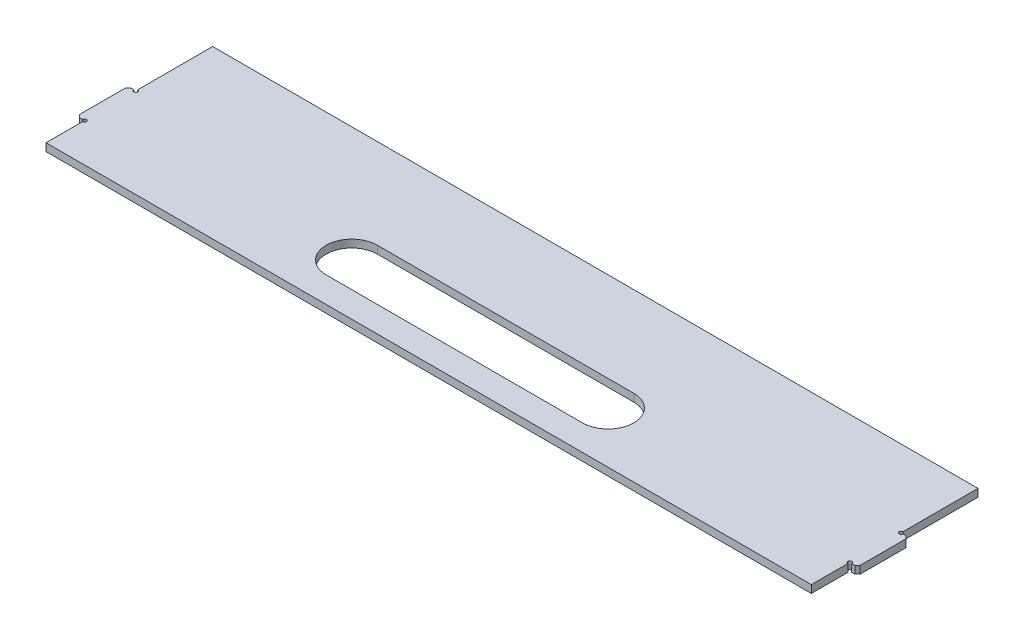
ISO-10303-21;
HEADER;
FILE_DESCRIPTION(('STEP AP214'),'2;1');
FILE_NAME('part.step','',(''),(''),'','','');
FILE_SCHEMA(('AUTOMOTIVE_DESIGN { 1 0 10303 214 1 1 1 1 }'));
ENDSEC;
DATA;
#1=APPLICATION_CONTEXT('core data for automotive mechanical design processes');
#2=APPLICATION_PROTOCOL_DEFINITION('international standard','automotive_design',2000,#1);
#3=PRODUCT_CONTEXT('',#1,'mechanical');
#4=PRODUCT('Part','Part','',(#3));
#5=PRODUCT_RELATED_PRODUCT_CATEGORY('part','',(#4));
#6=PRODUCT_DEFINITION_FORMATION('','',#4);
#7=PRODUCT_DEFINITION_CONTEXT('part definition',#1,'design');
#8=PRODUCT_DEFINITION('design','',#6,#7);
#9=PRODUCT_DEFINITION_SHAPE('','',#8);
#10=(LENGTH_UNIT() NAMED_UNIT(*) SI_UNIT(.MILLI.,.METRE.));
#11=(NAMED_UNIT(*) PLANE_ANGLE_UNIT() SI_UNIT($,.RADIAN.));
#12=(NAMED_UNIT(*) SI_UNIT($,.STERADIAN.) SOLID_ANGLE_UNIT());
#13=UNCERTAINTY_MEASURE_WITH_UNIT(LENGTH_MEASURE(1.E-05),#10,'distance_accuracy_value','');
#14=(GEOMETRIC_REPRESENTATION_CONTEXT(3) GLOBAL_UNCERTAINTY_ASSIGNED_CONTEXT((#13)) GLOBAL_UNIT_ASSIGNED_CONTEXT((#10,
#11,#12)) REPRESENTATION_CONTEXT('',''));
#15=CARTESIAN_POINT('',(0.,0.,0.));
#16=DIRECTION('',(0.,0.,1.));
#17=DIRECTION('',(1.,0.,0.));
#18=AXIS2_PLACEMENT_3D('',#15,#16,#17);
#19=CARTESIAN_POINT('',(149.25,-3.,32.5));
#20=DIRECTION('',(1.,0.,0.));
#21=DIRECTION('',(0.,0.,-1.));
#22=AXIS2_PLACEMENT_3D('',#19,#20,#21);
#23=PLANE('',#22);
#24=DIRECTION('',(0.,-1.,0.));
#25=VECTOR('',#24,1.);
#26=CARTESIAN_POINT('',(149.25,-3.,18.25));
#27=LINE('',#26,#25);
#28=CARTESIAN_POINT('',(149.25,0.,18.25));
#29=VERTEX_POINT('',#28);
#30=CARTESIAN_POINT('',(149.25,-3.,18.25));
#31=VERTEX_POINT('',#30);
#32=EDGE_CURVE('E100',#29,#31,#27,.T.);
#33=ORIENTED_EDGE('',*,*,#32,.F.);
#34=DIRECTION('',(0.,0.,-1.));
#35=VECTOR('',#34,1.);
#36=CARTESIAN_POINT('',(149.25,0.,32.5));
#37=LINE('',#36,#35);
#38=CARTESIAN_POINT('',(149.25,0.,32.5));
#39=VERTEX_POINT('',#38);
#40=EDGE_CURVE('E382',#39,#29,#37,.T.);
#41=ORIENTED_EDGE('',*,*,#40,.F.);
#42=DIRECTION('',(0.,1.,0.));
#43=VECTOR('',#42,1.);
#44=CARTESIAN_POINT('',(149.25,-3.,32.5));
#45=LINE('',#44,#43);
#46=CARTESIAN_POINT('',(149.25,-3.,32.5));
#47=VERTEX_POINT('',#46);
#48=EDGE_CURVE('E395',#47,#39,#45,.T.);
#49=ORIENTED_EDGE('',*,*,#48,.F.);
#50=DIRECTION('',(0.,0.,-1.));
#51=VECTOR('',#50,1.);
#52=CARTESIAN_POINT('',(149.25,-3.,32.5));
#53=LINE('',#52,#51);
#54=EDGE_CURVE('E367',#47,#31,#53,.T.);
#55=ORIENTED_EDGE('',*,*,#54,.T.);
#56=EDGE_LOOP('',(#33,#41,#49,#55));
#57=FACE_BOUND('',#56,.T.);
#58=ADVANCED_FACE('F93',(#57),#23,.T.);
#59=DIRECTION('',(0.,-1.,0.));
#60=VECTOR('',#59,1.);
#61=CARTESIAN_POINT('',(149.25,-3.,-3.24999999999998));
#62=LINE('',#61,#60);
#63=CARTESIAN_POINT('',(149.25,-3.,-3.24999999999998));
#64=VERTEX_POINT('',#63);
#65=CARTESIAN_POINT('',(149.25,0.,-3.24999999999998));
#66=VERTEX_POINT('',#65);
#67=EDGE_CURVE('E107',#64,#66,#62,.F.);
#68=ORIENTED_EDGE('',*,*,#67,.F.);
#69=CARTESIAN_POINT('',(149.25,-3.,-32.5));
#70=VERTEX_POINT('',#69);
#71=EDGE_CURVE('E371',#64,#70,#53,.T.);
#72=ORIENTED_EDGE('',*,*,#71,.T.);
#73=DIRECTION('',(0.,1.,0.));
#74=VECTOR('',#73,1.);
#75=CARTESIAN_POINT('',(149.25,-3.,-32.5));
#76=LINE('',#75,#74);
#77=CARTESIAN_POINT('',(149.25,0.,-32.5));
#78=VERTEX_POINT('',#77);
#79=EDGE_CURVE('E381',#70,#78,#76,.T.);
#80=ORIENTED_EDGE('',*,*,#79,.T.);
#81=EDGE_CURVE('E360',#66,#78,#37,.T.);
#82=ORIENTED_EDGE('',*,*,#81,.F.);
#83=EDGE_LOOP('',(#68,#72,#80,#82));
#84=FACE_BOUND('',#83,.T.);
#85=ADVANCED_FACE('F474',(#84),#23,.T.);
#86=CARTESIAN_POINT('',(-149.25,-3.,32.5));
#87=DIRECTION('',(-1.,0.,0.));
#88=DIRECTION('',(0.,0.,1.));
#89=AXIS2_PLACEMENT_3D('',#86,#87,#88);
#90=PLANE('',#89);
#91=DIRECTION('',(0.,-1.,0.));
#92=VECTOR('',#91,1.);
#93=CARTESIAN_POINT('',(-149.25,-3.,18.25));
#94=LINE('',#93,#92);
#95=CARTESIAN_POINT('',(-149.25,-3.,18.25));
#96=VERTEX_POINT('',#95);
#97=CARTESIAN_POINT('',(-149.25,0.,18.25));
#98=VERTEX_POINT('',#97);
#99=EDGE_CURVE('E273',#96,#98,#94,.F.);
#100=ORIENTED_EDGE('',*,*,#99,.F.);
#101=DIRECTION('',(0.,0.,1.));
#102=VECTOR('',#101,1.);
#103=CARTESIAN_POINT('',(-149.25,-3.,32.5));
#104=LINE('',#103,#102);
#105=CARTESIAN_POINT('',(-149.25,-3.,32.5));
#106=VERTEX_POINT('',#105);
#107=EDGE_CURVE('E374',#96,#106,#104,.T.);
#108=ORIENTED_EDGE('',*,*,#107,.T.);
#109=DIRECTION('',(0.,1.,0.));
#110=VECTOR('',#109,1.);
#111=CARTESIAN_POINT('',(-149.25,-3.,32.5));
#112=LINE('',#111,#110);
#113=CARTESIAN_POINT('',(-149.25,0.,32.5));
#114=VERTEX_POINT('',#113);
#115=EDGE_CURVE('E398',#106,#114,#112,.T.);
#116=ORIENTED_EDGE('',*,*,#115,.T.);
#117=DIRECTION('',(0.,0.,1.));
#118=VECTOR('',#117,1.);
#119=CARTESIAN_POINT('',(-149.25,0.,32.5));
#120=LINE('',#119,#118);
#121=EDGE_CURVE('E388',#98,#114,#120,.T.);
#122=ORIENTED_EDGE('',*,*,#121,.F.);
#123=EDGE_LOOP('',(#100,#108,#116,#122));
#124=FACE_BOUND('',#123,.T.);
#125=ADVANCED_FACE('F500',(#124),#90,.T.);
#126=DIRECTION('',(0.,-1.,0.));
#127=VECTOR('',#126,1.);
#128=CARTESIAN_POINT('',(-149.25,-3.,-3.24999999999998));
#129=LINE('',#128,#127);
#130=CARTESIAN_POINT('',(-149.25,0.,-3.24999999999998));
#131=VERTEX_POINT('',#130);
#132=CARTESIAN_POINT('',(-149.25,-3.,-3.24999999999998));
#133=VERTEX_POINT('',#132);
#134=EDGE_CURVE('E415',#131,#133,#129,.T.);
#135=ORIENTED_EDGE('',*,*,#134,.F.);
#136=CARTESIAN_POINT('',(-149.25,0.,-32.5));
#137=VERTEX_POINT('',#136);
#138=EDGE_CURVE('E389',#137,#131,#120,.T.);
#139=ORIENTED_EDGE('',*,*,#138,.F.);
#140=DIRECTION('',(0.,1.,0.));
#141=VECTOR('',#140,1.);
#142=CARTESIAN_POINT('',(-149.25,-3.,-32.5));
#143=LINE('',#142,#141);
#144=CARTESIAN_POINT('',(-149.25,-3.,-32.5));
#145=VERTEX_POINT('',#144);
#146=EDGE_CURVE('E401',#145,#137,#143,.T.);
#147=ORIENTED_EDGE('',*,*,#146,.F.);
#148=EDGE_CURVE('E375',#145,#133,#104,.T.);
#149=ORIENTED_EDGE('',*,*,#148,.T.);
#150=EDGE_LOOP('',(#135,#139,#147,#149));
#151=FACE_BOUND('',#150,.T.);
#152=ADVANCED_FACE('F468',(#151),#90,.T.);
#153=CARTESIAN_POINT('',(-149.25,-3.,32.5));
#154=DIRECTION('',(0.,0.,1.));
#155=DIRECTION('',(1.,0.,0.));
#156=AXIS2_PLACEMENT_3D('',#153,#154,#155);
#157=PLANE('',#156);
#158=DIRECTION('',(1.,0.,0.));
#159=VECTOR('',#158,1.);
#160=CARTESIAN_POINT('',(-149.25,0.,32.5));
#161=LINE('',#160,#159);
#162=EDGE_CURVE('E392',#114,#39,#161,.T.);
#163=ORIENTED_EDGE('',*,*,#162,.F.);
#164=ORIENTED_EDGE('',*,*,#115,.F.);
#165=DIRECTION('',(1.,0.,0.));
#166=VECTOR('',#165,1.);
#167=CARTESIAN_POINT('',(-149.25,-3.,32.5));
#168=LINE('',#167,#166);
#169=EDGE_CURVE('E378',#106,#47,#168,.T.);
#170=ORIENTED_EDGE('',*,*,#169,.T.);
#171=ORIENTED_EDGE('',*,*,#48,.T.);
#172=EDGE_LOOP('',(#163,#164,#170,#171));
#173=FACE_BOUND('',#172,.T.);
#174=ADVANCED_FACE('F504',(#173),#157,.T.);
#175=CARTESIAN_POINT('',(-149.25,-3.,-32.5));
#176=DIRECTION('',(0.,0.,-1.));
#177=DIRECTION('',(-1.,0.,0.));
#178=AXIS2_PLACEMENT_3D('',#175,#176,#177);
#179=PLANE('',#178);
#180=DIRECTION('',(-1.,0.,0.));
#181=VECTOR('',#180,1.);
#182=CARTESIAN_POINT('',(-149.25,0.,-32.5));
#183=LINE('',#182,#181);
#184=EDGE_CURVE('E385',#78,#137,#183,.T.);
#185=ORIENTED_EDGE('',*,*,#184,.F.);
#186=ORIENTED_EDGE('',*,*,#79,.F.);
#187=DIRECTION('',(-1.,0.,0.));
#188=VECTOR('',#187,1.);
#189=CARTESIAN_POINT('',(-149.25,-3.,-32.5));
#190=LINE('',#189,#188);
#191=EDGE_CURVE('E370',#70,#145,#190,.T.);
#192=ORIENTED_EDGE('',*,*,#191,.T.);
#193=ORIENTED_EDGE('',*,*,#146,.T.);
#194=EDGE_LOOP('',(#185,#186,#192,#193));
#195=FACE_BOUND('',#194,.T.);
#196=ADVANCED_FACE('F471',(#195),#179,.T.);
#197=CARTESIAN_POINT('',(0.,-3.,0.));
#198=DIRECTION('',(0.,-1.,0.));
#199=DIRECTION('',(0.,0.,-1.));
#200=AXIS2_PLACEMENT_3D('',#197,#198,#199);
#201=PLANE('',#200);
#202=CARTESIAN_POINT('',(149.25,-3.,-2.50000000000001));
#203=DIRECTION('',(0.,-1.,0.));
#204=DIRECTION('',(0.,0.,-1.));
#205=AXIS2_PLACEMENT_3D('',#202,#203,#204);
#206=CIRCLE('',#205,0.749999999999973);
#207=CARTESIAN_POINT('',(150.,-3.,-2.50000000000001));
#208=VERTEX_POINT('',#207);
#209=EDGE_CURVE('E263',#208,#64,#206,.T.);
#210=ORIENTED_EDGE('',*,*,#209,.F.);
#211=DIRECTION('',(-1.,0.,0.));
#212=VECTOR('',#211,1.);
#213=CARTESIAN_POINT('',(155.25,-3.,-2.50000000000001));
#214=LINE('',#213,#212);
#215=CARTESIAN_POINT('',(151.25,-3.,-2.50000000000001));
#216=VERTEX_POINT('',#215);
#217=EDGE_CURVE('E262',#216,#208,#214,.T.);
#218=ORIENTED_EDGE('',*,*,#217,.F.);
#219=DIRECTION('',(0.707106781186537,0.,0.707106781186558));
#220=VECTOR('',#219,1.);
#221=CARTESIAN_POINT('',(153.25,-3.,-0.499999999999934));
#222=LINE('',#221,#220);
#223=CARTESIAN_POINT('',(152.25,-3.,-1.49999999999999));
#224=VERTEX_POINT('',#223);
#225=EDGE_CURVE('E294',#216,#224,#222,.T.);
#226=ORIENTED_EDGE('',*,*,#225,.T.);
#227=DIRECTION('',(0.,0.,-1.));
#228=VECTOR('',#227,1.);
#229=CARTESIAN_POINT('',(152.25,-3.,-2.50000000000001));
#230=LINE('',#229,#228);
#231=CARTESIAN_POINT('',(152.25,-3.,16.5));
#232=VERTEX_POINT('',#231);
#233=EDGE_CURVE('E281',#232,#224,#230,.T.);
#234=ORIENTED_EDGE('',*,*,#233,.F.);
#235=DIRECTION('',(-0.707106781186546,0.,0.707106781186549));
#236=VECTOR('',#235,1.);
#237=CARTESIAN_POINT('',(163.25,-3.,5.49999999999986));
#238=LINE('',#237,#236);
#239=CARTESIAN_POINT('',(151.25,-3.,17.5));
#240=VERTEX_POINT('',#239);
#241=EDGE_CURVE('E292',#232,#240,#238,.T.);
#242=ORIENTED_EDGE('',*,*,#241,.T.);
#243=DIRECTION('',(-1.,0.,0.));
#244=VECTOR('',#243,1.);
#245=CARTESIAN_POINT('',(155.25,-3.,17.5));
#246=LINE('',#245,#244);
#247=CARTESIAN_POINT('',(150.,-3.,17.5));
#248=VERTEX_POINT('',#247);
#249=EDGE_CURVE('E270',#240,#248,#246,.T.);
#250=ORIENTED_EDGE('',*,*,#249,.T.);
#251=CARTESIAN_POINT('',(149.25,-3.,17.5));
#252=DIRECTION('',(0.,-1.,0.));
#253=DIRECTION('',(0.,0.,-1.));
#254=AXIS2_PLACEMENT_3D('',#251,#252,#253);
#255=CIRCLE('',#254,0.749999999999973);
#256=EDGE_CURVE('E426',#31,#248,#255,.T.);
#257=ORIENTED_EDGE('',*,*,#256,.F.);
#258=ORIENTED_EDGE('',*,*,#54,.F.);
#259=ORIENTED_EDGE('',*,*,#169,.F.);
#260=ORIENTED_EDGE('',*,*,#107,.F.);
#261=CARTESIAN_POINT('',(-149.25,-3.,17.5));
#262=DIRECTION('',(0.,-1.,0.));
#263=DIRECTION('',(0.,0.,-1.));
#264=AXIS2_PLACEMENT_3D('',#261,#262,#263);
#265=CIRCLE('',#264,0.749999999999973);
#266=CARTESIAN_POINT('',(-150.,-3.,17.5));
#267=VERTEX_POINT('',#266);
#268=EDGE_CURVE('E406',#267,#96,#265,.T.);
#269=ORIENTED_EDGE('',*,*,#268,.F.);
#270=DIRECTION('',(1.,0.,0.));
#271=VECTOR('',#270,1.);
#272=CARTESIAN_POINT('',(-155.25,-3.,17.5));
#273=LINE('',#272,#271);
#274=CARTESIAN_POINT('',(-151.25,-3.,17.5));
#275=VERTEX_POINT('',#274);
#276=EDGE_CURVE('E309',#275,#267,#273,.T.);
#277=ORIENTED_EDGE('',*,*,#276,.F.);
#278=DIRECTION('',(0.707106781186544,0.,0.707106781186551));
#279=VECTOR('',#278,1.);
#280=CARTESIAN_POINT('',(-153.25,-3.,15.5));
#281=LINE('',#280,#279);
#282=CARTESIAN_POINT('',(-152.25,-3.,16.5));
#283=VERTEX_POINT('',#282);
#284=EDGE_CURVE('E327',#275,#283,#281,.F.);
#285=ORIENTED_EDGE('',*,*,#284,.T.);
#286=DIRECTION('',(0.,0.,-1.));
#287=VECTOR('',#286,1.);
#288=CARTESIAN_POINT('',(-152.25,-3.,17.5));
#289=LINE('',#288,#287);
#290=CARTESIAN_POINT('',(-152.25,-3.,-1.50000000000002));
#291=VERTEX_POINT('',#290);
#292=EDGE_CURVE('E298',#283,#291,#289,.T.);
#293=ORIENTED_EDGE('',*,*,#292,.T.);
#294=DIRECTION('',(-0.707106781186555,0.,0.70710678118654));
#295=VECTOR('',#294,1.);
#296=CARTESIAN_POINT('',(-163.25,-3.,9.49999999999976));
#297=LINE('',#296,#295);
#298=CARTESIAN_POINT('',(-151.25,-3.,-2.50000000000001));
#299=VERTEX_POINT('',#298);
#300=EDGE_CURVE('E329',#291,#299,#297,.F.);
#301=ORIENTED_EDGE('',*,*,#300,.T.);
#302=DIRECTION('',(1.,0.,0.));
#303=VECTOR('',#302,1.);
#304=CARTESIAN_POINT('',(-155.25,-3.,-2.50000000000001));
#305=LINE('',#304,#303);
#306=CARTESIAN_POINT('',(-150.,-3.,-2.50000000000001));
#307=VERTEX_POINT('',#306);
#308=EDGE_CURVE('E301',#299,#307,#305,.T.);
#309=ORIENTED_EDGE('',*,*,#308,.T.);
#310=CARTESIAN_POINT('',(-149.25,-3.,-2.50000000000001));
#311=DIRECTION('',(0.,-1.,0.));
#312=DIRECTION('',(0.,0.,-1.));
#313=AXIS2_PLACEMENT_3D('',#310,#311,#312);
#314=CIRCLE('',#313,0.749999999999973);
#315=EDGE_CURVE('E454',#133,#307,#314,.T.);
#316=ORIENTED_EDGE('',*,*,#315,.F.);
#317=ORIENTED_EDGE('',*,*,#148,.F.);
#318=ORIENTED_EDGE('',*,*,#191,.F.);
#319=ORIENTED_EDGE('',*,*,#71,.F.);
#320=EDGE_LOOP('',(#210,#218,#226,#234,#242,#250,#257,#258,#259,#260,#269,#277,#285,#293,#301,
#309,#316,#317,#318,#319));
#321=FACE_BOUND('',#320,.T.);
#322=CARTESIAN_POINT('',(-50.,-3.,12.5));
#323=DIRECTION('',(0.,1.,0.));
#324=DIRECTION('',(0.,0.,1.));
#325=AXIS2_PLACEMENT_3D('',#322,#323,#324);
#326=CIRCLE('',#325,10.);
#327=CARTESIAN_POINT('',(-50.,-3.,2.49999999999999));
#328=VERTEX_POINT('',#327);
#329=CARTESIAN_POINT('',(-50.,-3.,22.5));
#330=VERTEX_POINT('',#329);
#331=EDGE_CURVE('E335',#328,#330,#326,.T.);
#332=ORIENTED_EDGE('',*,*,#331,.T.);
#333=DIRECTION('',(1.,0.,0.));
#334=VECTOR('',#333,1.);
#335=CARTESIAN_POINT('',(-50.,-3.,22.5));
#336=LINE('',#335,#334);
#337=CARTESIAN_POINT('',(50.,-3.,22.5));
#338=VERTEX_POINT('',#337);
#339=EDGE_CURVE('E338',#330,#338,#336,.T.);
#340=ORIENTED_EDGE('',*,*,#339,.T.);
#341=CARTESIAN_POINT('',(50.,-3.,12.5));
#342=DIRECTION('',(0.,1.,0.));
#343=DIRECTION('',(0.,0.,1.));
#344=AXIS2_PLACEMENT_3D('',#341,#342,#343);
#345=CIRCLE('',#344,10.);
#346=CARTESIAN_POINT('',(50.,-3.,2.49999999999999));
#347=VERTEX_POINT('',#346);
#348=EDGE_CURVE('E342',#338,#347,#345,.T.);
#349=ORIENTED_EDGE('',*,*,#348,.T.);
#350=DIRECTION('',(-1.,0.,0.));
#351=VECTOR('',#350,1.);
#352=CARTESIAN_POINT('',(-50.,-3.,2.49999999999999));
#353=LINE('',#352,#351);
#354=EDGE_CURVE('E345',#347,#328,#353,.T.);
#355=ORIENTED_EDGE('',*,*,#354,.T.);
#356=EDGE_LOOP('',(#332,#340,#349,#355));
#357=FACE_BOUND('',#356,.T.);
#358=ADVANCED_FACE('F423',(#321,#357),#201,.T.);
#359=CARTESIAN_POINT('',(0.,0.,0.));
#360=DIRECTION('',(0.,-1.,0.));
#361=DIRECTION('',(0.,0.,-1.));
#362=AXIS2_PLACEMENT_3D('',#359,#360,#361);
#363=PLANE('',#362);
#364=DIRECTION('',(1.,0.,0.));
#365=VECTOR('',#364,1.);
#366=CARTESIAN_POINT('',(-50.,0.,22.5));
#367=LINE('',#366,#365);
#368=CARTESIAN_POINT('',(-50.,0.,22.5));
#369=VERTEX_POINT('',#368);
#370=CARTESIAN_POINT('',(50.,0.,22.5));
#371=VERTEX_POINT('',#370);
#372=EDGE_CURVE('E350',#369,#371,#367,.T.);
#373=ORIENTED_EDGE('',*,*,#372,.F.);
#374=CARTESIAN_POINT('',(-50.,0.,12.5));
#375=DIRECTION('',(0.,1.,0.));
#376=DIRECTION('',(0.,0.,1.));
#377=AXIS2_PLACEMENT_3D('',#374,#375,#376);
#378=CIRCLE('',#377,10.);
#379=CARTESIAN_POINT('',(-50.,0.,2.49999999999999));
#380=VERTEX_POINT('',#379);
#381=EDGE_CURVE('E334',#380,#369,#378,.T.);
#382=ORIENTED_EDGE('',*,*,#381,.F.);
#383=DIRECTION('',(-1.,0.,0.));
#384=VECTOR('',#383,1.);
#385=CARTESIAN_POINT('',(-50.,0.,2.49999999999999));
#386=LINE('',#385,#384);
#387=CARTESIAN_POINT('',(50.,0.,2.49999999999999));
#388=VERTEX_POINT('',#387);
#389=EDGE_CURVE('E339',#388,#380,#386,.T.);
#390=ORIENTED_EDGE('',*,*,#389,.F.);
#391=CARTESIAN_POINT('',(50.,0.,12.5));
#392=DIRECTION('',(0.,1.,0.));
#393=DIRECTION('',(0.,0.,1.));
#394=AXIS2_PLACEMENT_3D('',#391,#392,#393);
#395=CIRCLE('',#394,10.);
#396=EDGE_CURVE('E353',#371,#388,#395,.T.);
#397=ORIENTED_EDGE('',*,*,#396,.F.);
#398=EDGE_LOOP('',(#373,#382,#390,#397));
#399=FACE_BOUND('',#398,.T.);
#400=DIRECTION('',(-1.,0.,0.));
#401=VECTOR('',#400,1.);
#402=CARTESIAN_POINT('',(155.25,0.,-2.50000000000001));
#403=LINE('',#402,#401);
#404=CARTESIAN_POINT('',(151.25,0.,-2.50000000000001));
#405=VERTEX_POINT('',#404);
#406=CARTESIAN_POINT('',(150.,0.,-2.50000000000001));
#407=VERTEX_POINT('',#406);
#408=EDGE_CURVE('E259',#405,#407,#403,.T.);
#409=ORIENTED_EDGE('',*,*,#408,.T.);
#410=CARTESIAN_POINT('',(149.25,0.,-2.50000000000001));
#411=DIRECTION('',(0.,-1.,0.));
#412=DIRECTION('',(0.,0.,-1.));
#413=AXIS2_PLACEMENT_3D('',#410,#411,#412);
#414=CIRCLE('',#413,0.749999999999973);
#415=EDGE_CURVE('E13',#407,#66,#414,.T.);
#416=ORIENTED_EDGE('',*,*,#415,.T.);
#417=ORIENTED_EDGE('',*,*,#81,.T.);
#418=ORIENTED_EDGE('',*,*,#184,.T.);
#419=ORIENTED_EDGE('',*,*,#138,.T.);
#420=CARTESIAN_POINT('',(-149.25,0.,-2.50000000000001));
#421=DIRECTION('',(0.,-1.,0.));
#422=DIRECTION('',(0.,0.,-1.));
#423=AXIS2_PLACEMENT_3D('',#420,#421,#422);
#424=CIRCLE('',#423,0.749999999999973);
#425=CARTESIAN_POINT('',(-150.,0.,-2.50000000000001));
#426=VERTEX_POINT('',#425);
#427=EDGE_CURVE('E456',#131,#426,#424,.T.);
#428=ORIENTED_EDGE('',*,*,#427,.T.);
#429=DIRECTION('',(1.,0.,0.));
#430=VECTOR('',#429,1.);
#431=CARTESIAN_POINT('',(-155.25,0.,-2.50000000000001));
#432=LINE('',#431,#430);
#433=CARTESIAN_POINT('',(-151.25,0.,-2.50000000000001));
#434=VERTEX_POINT('',#433);
#435=EDGE_CURVE('E306',#434,#426,#432,.T.);
#436=ORIENTED_EDGE('',*,*,#435,.F.);
#437=DIRECTION('',(0.707106781186555,0.,-0.70710678118654));
#438=VECTOR('',#437,1.);
#439=CARTESIAN_POINT('',(-153.25,0.,-0.500000000000018));
#440=LINE('',#439,#438);
#441=CARTESIAN_POINT('',(-152.25,0.,-1.50000000000001));
#442=VERTEX_POINT('',#441);
#443=EDGE_CURVE('E321',#434,#442,#440,.F.);
#444=ORIENTED_EDGE('',*,*,#443,.T.);
#445=DIRECTION('',(0.,0.,1.));
#446=VECTOR('',#445,1.);
#447=CARTESIAN_POINT('',(-152.25,0.,-2.5));
#448=LINE('',#447,#446);
#449=CARTESIAN_POINT('',(-152.25,0.,16.5));
#450=VERTEX_POINT('',#449);
#451=EDGE_CURVE('E302',#442,#450,#448,.T.);
#452=ORIENTED_EDGE('',*,*,#451,.T.);
#453=DIRECTION('',(-0.707106781186544,0.,-0.707106781186551));
#454=VECTOR('',#453,1.);
#455=CARTESIAN_POINT('',(-163.25,0.,5.49999999999993));
#456=LINE('',#455,#454);
#457=CARTESIAN_POINT('',(-151.25,0.,17.5));
#458=VERTEX_POINT('',#457);
#459=EDGE_CURVE('E319',#450,#458,#456,.F.);
#460=ORIENTED_EDGE('',*,*,#459,.T.);
#461=DIRECTION('',(1.,0.,0.));
#462=VECTOR('',#461,1.);
#463=CARTESIAN_POINT('',(-155.25,0.,17.5));
#464=LINE('',#463,#462);
#465=CARTESIAN_POINT('',(-150.,0.,17.5));
#466=VERTEX_POINT('',#465);
#467=EDGE_CURVE('E305',#458,#466,#464,.T.);
#468=ORIENTED_EDGE('',*,*,#467,.T.);
#469=CARTESIAN_POINT('',(-149.25,0.,17.5));
#470=DIRECTION('',(0.,-1.,0.));
#471=DIRECTION('',(0.,0.,-1.));
#472=AXIS2_PLACEMENT_3D('',#469,#470,#471);
#473=CIRCLE('',#472,0.749999999999973);
#474=EDGE_CURVE('E397',#466,#98,#473,.T.);
#475=ORIENTED_EDGE('',*,*,#474,.T.);
#476=ORIENTED_EDGE('',*,*,#121,.T.);
#477=ORIENTED_EDGE('',*,*,#162,.T.);
#478=ORIENTED_EDGE('',*,*,#40,.T.);
#479=CARTESIAN_POINT('',(149.25,0.,17.5));
#480=DIRECTION('',(0.,-1.,0.));
#481=DIRECTION('',(0.,0.,-1.));
#482=AXIS2_PLACEMENT_3D('',#479,#480,#481);
#483=CIRCLE('',#482,0.749999999999973);
#484=CARTESIAN_POINT('',(150.,0.,17.5));
#485=VERTEX_POINT('',#484);
#486=EDGE_CURVE('E451',#29,#485,#483,.T.);
#487=ORIENTED_EDGE('',*,*,#486,.T.);
#488=DIRECTION('',(-1.,0.,0.));
#489=VECTOR('',#488,1.);
#490=CARTESIAN_POINT('',(155.25,0.,17.5));
#491=LINE('',#490,#489);
#492=CARTESIAN_POINT('',(151.25,0.,17.5));
#493=VERTEX_POINT('',#492);
#494=EDGE_CURVE('E268',#493,#485,#491,.T.);
#495=ORIENTED_EDGE('',*,*,#494,.F.);
#496=DIRECTION('',(0.707106781186546,0.,-0.707106781186549));
#497=VECTOR('',#496,1.);
#498=CARTESIAN_POINT('',(153.25,0.,15.4999999999999));
#499=LINE('',#498,#497);
#500=CARTESIAN_POINT('',(152.25,0.,16.5));
#501=VERTEX_POINT('',#500);
#502=EDGE_CURVE('E287',#493,#501,#499,.T.);
#503=ORIENTED_EDGE('',*,*,#502,.T.);
#504=DIRECTION('',(0.,0.,1.));
#505=VECTOR('',#504,1.);
#506=CARTESIAN_POINT('',(152.25,0.,17.5));
#507=LINE('',#506,#505);
#508=CARTESIAN_POINT('',(152.25,0.,-1.49999999999999));
#509=VERTEX_POINT('',#508);
#510=EDGE_CURVE('E277',#509,#501,#507,.T.);
#511=ORIENTED_EDGE('',*,*,#510,.F.);
#512=DIRECTION('',(-0.707106781186537,0.,-0.707106781186558));
#513=VECTOR('',#512,1.);
#514=CARTESIAN_POINT('',(163.25,0.,9.50000000000036));
#515=LINE('',#514,#513);
#516=EDGE_CURVE('E267',#509,#405,#515,.T.);
#517=ORIENTED_EDGE('',*,*,#516,.T.);
#518=EDGE_LOOP('',(#409,#416,#417,#418,#419,#428,#436,#444,#452,#460,#468,#475,#476,#477,#478,
#487,#495,#503,#511,#517));
#519=FACE_BOUND('',#518,.T.);
#520=ADVANCED_FACE('F265',(#399,#519),#363,.F.);
#521=CARTESIAN_POINT('',(-50.,-3.,12.5));
#522=DIRECTION('',(0.,1.,0.));
#523=DIRECTION('',(0.,0.,1.));
#524=AXIS2_PLACEMENT_3D('',#521,#522,#523);
#525=CYLINDRICAL_SURFACE('',#524,10.);
#526=ORIENTED_EDGE('',*,*,#381,.T.);
#527=DIRECTION('',(0.,1.,0.));
#528=VECTOR('',#527,1.);
#529=CARTESIAN_POINT('',(-50.,-3.,22.5));
#530=LINE('',#529,#528);
#531=EDGE_CURVE('E348',#330,#369,#530,.T.);
#532=ORIENTED_EDGE('',*,*,#531,.F.);
#533=ORIENTED_EDGE('',*,*,#331,.F.);
#534=DIRECTION('',(0.,1.,0.));
#535=VECTOR('',#534,1.);
#536=CARTESIAN_POINT('',(-50.,-3.,2.49999999999999));
#537=LINE('',#536,#535);
#538=EDGE_CURVE('E358',#328,#380,#537,.T.);
#539=ORIENTED_EDGE('',*,*,#538,.T.);
#540=EDGE_LOOP('',(#526,#532,#533,#539));
#541=FACE_BOUND('',#540,.T.);
#542=ADVANCED_FACE('F563',(#541),#525,.F.);
#543=CARTESIAN_POINT('',(-50.,-3.,2.49999999999999));
#544=DIRECTION('',(0.,0.,-1.));
#545=DIRECTION('',(-1.,0.,0.));
#546=AXIS2_PLACEMENT_3D('',#543,#544,#545);
#547=PLANE('',#546);
#548=ORIENTED_EDGE('',*,*,#389,.T.);
#549=ORIENTED_EDGE('',*,*,#538,.F.);
#550=ORIENTED_EDGE('',*,*,#354,.F.);
#551=DIRECTION('',(0.,1.,0.));
#552=VECTOR('',#551,1.);
#553=CARTESIAN_POINT('',(50.,-3.,2.49999999999999));
#554=LINE('',#553,#552);
#555=EDGE_CURVE('E361',#347,#388,#554,.T.);
#556=ORIENTED_EDGE('',*,*,#555,.T.);
#557=EDGE_LOOP('',(#548,#549,#550,#556));
#558=FACE_BOUND('',#557,.T.);
#559=ADVANCED_FACE('F694',(#558),#547,.F.);
#560=CARTESIAN_POINT('',(50.,-3.,12.5));
#561=DIRECTION('',(0.,1.,0.));
#562=DIRECTION('',(0.,0.,1.));
#563=AXIS2_PLACEMENT_3D('',#560,#561,#562);
#564=CYLINDRICAL_SURFACE('',#563,10.);
#565=ORIENTED_EDGE('',*,*,#396,.T.);
#566=ORIENTED_EDGE('',*,*,#555,.F.);
#567=ORIENTED_EDGE('',*,*,#348,.F.);
#568=DIRECTION('',(0.,1.,0.));
#569=VECTOR('',#568,1.);
#570=CARTESIAN_POINT('',(50.,-3.,22.5));
#571=LINE('',#570,#569);
#572=EDGE_CURVE('E363',#338,#371,#571,.T.);
#573=ORIENTED_EDGE('',*,*,#572,.T.);
#574=EDGE_LOOP('',(#565,#566,#567,#573));
#575=FACE_BOUND('',#574,.T.);
#576=ADVANCED_FACE('F684',(#575),#564,.F.);
#577=CARTESIAN_POINT('',(-50.,-3.,22.5));
#578=DIRECTION('',(0.,0.,1.));
#579=DIRECTION('',(1.,0.,0.));
#580=AXIS2_PLACEMENT_3D('',#577,#578,#579);
#581=PLANE('',#580);
#582=ORIENTED_EDGE('',*,*,#372,.T.);
#583=ORIENTED_EDGE('',*,*,#572,.F.);
#584=ORIENTED_EDGE('',*,*,#339,.F.);
#585=ORIENTED_EDGE('',*,*,#531,.T.);
#586=EDGE_LOOP('',(#582,#583,#584,#585));
#587=FACE_BOUND('',#586,.T.);
#588=ADVANCED_FACE('F674',(#587),#581,.F.);
#589=CARTESIAN_POINT('',(-152.25,55.5,-77.5));
#590=DIRECTION('',(-1.,0.,0.));
#591=DIRECTION('',(0.,1.,0.));
#592=AXIS2_PLACEMENT_3D('',#589,#590,#591);
#593=PLANE('',#592);
#594=ORIENTED_EDGE('',*,*,#451,.F.);
#595=DIRECTION('',(0.,-1.,0.));
#596=VECTOR('',#595,1.);
#597=CARTESIAN_POINT('',(-152.25,55.5,-1.50000000000002));
#598=LINE('',#597,#596);
#599=EDGE_CURVE('E325',#442,#291,#598,.T.);
#600=ORIENTED_EDGE('',*,*,#599,.T.);
#601=ORIENTED_EDGE('',*,*,#292,.F.);
#602=DIRECTION('',(0.,1.,0.));
#603=VECTOR('',#602,1.);
#604=CARTESIAN_POINT('',(-152.25,55.5,16.5));
#605=LINE('',#604,#603);
#606=EDGE_CURVE('E323',#283,#450,#605,.T.);
#607=ORIENTED_EDGE('',*,*,#606,.T.);
#608=EDGE_LOOP('',(#594,#600,#601,#607));
#609=FACE_BOUND('',#608,.T.);
#610=ADVANCED_FACE('F486',(#609),#593,.T.);
#611=CARTESIAN_POINT('',(-155.25,-3.,-2.50000000000001));
#612=DIRECTION('',(0.,0.,-1.));
#613=DIRECTION('',(-1.,0.,0.));
#614=AXIS2_PLACEMENT_3D('',#611,#612,#613);
#615=PLANE('',#614);
#616=DIRECTION('',(0.,-1.,0.));
#617=VECTOR('',#616,1.);
#618=CARTESIAN_POINT('',(-150.,-3.,-2.50000000000001));
#619=LINE('',#618,#617);
#620=EDGE_CURVE('E458',#307,#426,#619,.F.);
#621=ORIENTED_EDGE('',*,*,#620,.F.);
#622=ORIENTED_EDGE('',*,*,#308,.F.);
#623=DIRECTION('',(0.,1.,0.));
#624=VECTOR('',#623,1.);
#625=CARTESIAN_POINT('',(-151.25,-3.,-2.50000000000001));
#626=LINE('',#625,#624);
#627=EDGE_CURVE('E316',#299,#434,#626,.T.);
#628=ORIENTED_EDGE('',*,*,#627,.T.);
#629=ORIENTED_EDGE('',*,*,#435,.T.);
#630=EDGE_LOOP('',(#621,#622,#628,#629));
#631=FACE_BOUND('',#630,.T.);
#632=ADVANCED_FACE('F477',(#631),#615,.T.);
#633=CARTESIAN_POINT('',(-155.25,0.,17.5));
#634=DIRECTION('',(0.,0.,1.));
#635=DIRECTION('',(1.,0.,0.));
#636=AXIS2_PLACEMENT_3D('',#633,#634,#635);
#637=PLANE('',#636);
#638=DIRECTION('',(0.,-1.,0.));
#639=VECTOR('',#638,1.);
#640=CARTESIAN_POINT('',(-150.,-3.,17.5));
#641=LINE('',#640,#639);
#642=EDGE_CURVE('E405',#466,#267,#641,.T.);
#643=ORIENTED_EDGE('',*,*,#642,.F.);
#644=ORIENTED_EDGE('',*,*,#467,.F.);
#645=DIRECTION('',(0.,-1.,0.));
#646=VECTOR('',#645,1.);
#647=CARTESIAN_POINT('',(-151.25,0.,17.5));
#648=LINE('',#647,#646);
#649=EDGE_CURVE('E331',#458,#275,#648,.T.);
#650=ORIENTED_EDGE('',*,*,#649,.T.);
#651=ORIENTED_EDGE('',*,*,#276,.T.);
#652=EDGE_LOOP('',(#643,#644,#650,#651));
#653=FACE_BOUND('',#652,.T.);
#654=ADVANCED_FACE('F494',(#653),#637,.T.);
#655=CARTESIAN_POINT('',(-151.25,-3.,-2.50000000000001));
#656=DIRECTION('',(0.70710678118654,0.,0.707106781186555));
#657=DIRECTION('',(0.,1.,0.));
#658=AXIS2_PLACEMENT_3D('',#655,#656,#657);
#659=PLANE('',#658);
#660=ORIENTED_EDGE('',*,*,#300,.F.);
#661=ORIENTED_EDGE('',*,*,#599,.F.);
#662=ORIENTED_EDGE('',*,*,#443,.F.);
#663=ORIENTED_EDGE('',*,*,#627,.F.);
#664=EDGE_LOOP('',(#660,#661,#662,#663));
#665=FACE_BOUND('',#664,.T.);
#666=ADVANCED_FACE('F481',(#665),#659,.F.);
#667=CARTESIAN_POINT('',(-151.25,0.,17.5));
#668=DIRECTION('',(0.707106781186551,0.,-0.707106781186544));
#669=DIRECTION('',(0.,-1.,0.));
#670=AXIS2_PLACEMENT_3D('',#667,#668,#669);
#671=PLANE('',#670);
#672=ORIENTED_EDGE('',*,*,#459,.F.);
#673=ORIENTED_EDGE('',*,*,#606,.F.);
#674=ORIENTED_EDGE('',*,*,#284,.F.);
#675=ORIENTED_EDGE('',*,*,#649,.F.);
#676=EDGE_LOOP('',(#672,#673,#674,#675));
#677=FACE_BOUND('',#676,.T.);
#678=ADVANCED_FACE('F490',(#677),#671,.F.);
#679=CARTESIAN_POINT('',(155.25,-3.,17.5));
#680=DIRECTION('',(0.,0.,1.));
#681=DIRECTION('',(1.,0.,0.));
#682=AXIS2_PLACEMENT_3D('',#679,#680,#681);
#683=PLANE('',#682);
#684=DIRECTION('',(0.,-1.,0.));
#685=VECTOR('',#684,1.);
#686=CARTESIAN_POINT('',(150.,-3.,17.5));
#687=LINE('',#686,#685);
#688=EDGE_CURVE('E433',#248,#485,#687,.F.);
#689=ORIENTED_EDGE('',*,*,#688,.F.);
#690=ORIENTED_EDGE('',*,*,#249,.F.);
#691=DIRECTION('',(0.,1.,0.));
#692=VECTOR('',#691,1.);
#693=CARTESIAN_POINT('',(151.25,0.,17.5));
#694=LINE('',#693,#692);
#695=EDGE_CURVE('E296',#240,#493,#694,.T.);
#696=ORIENTED_EDGE('',*,*,#695,.T.);
#697=ORIENTED_EDGE('',*,*,#494,.T.);
#698=EDGE_LOOP('',(#689,#690,#696,#697));
#699=FACE_BOUND('',#698,.T.);
#700=ADVANCED_FACE('F431',(#699),#683,.T.);
#701=CARTESIAN_POINT('',(155.25,0.,-2.50000000000001));
#702=DIRECTION('',(0.,0.,-1.));
#703=DIRECTION('',(-1.,0.,0.));
#704=AXIS2_PLACEMENT_3D('',#701,#702,#703);
#705=PLANE('',#704);
#706=DIRECTION('',(0.,-1.,0.));
#707=VECTOR('',#706,1.);
#708=CARTESIAN_POINT('',(150.,-3.,-2.50000000000001));
#709=LINE('',#708,#707);
#710=EDGE_CURVE('E250',#407,#208,#709,.T.);
#711=ORIENTED_EDGE('',*,*,#710,.F.);
#712=ORIENTED_EDGE('',*,*,#408,.F.);
#713=DIRECTION('',(0.,-1.,0.));
#714=VECTOR('',#713,1.);
#715=CARTESIAN_POINT('',(151.25,-3.,-2.50000000000001));
#716=LINE('',#715,#714);
#717=EDGE_CURVE('E290',#405,#216,#716,.T.);
#718=ORIENTED_EDGE('',*,*,#717,.T.);
#719=ORIENTED_EDGE('',*,*,#217,.T.);
#720=EDGE_LOOP('',(#711,#712,#718,#719));
#721=FACE_BOUND('',#720,.T.);
#722=ADVANCED_FACE('F258',(#721),#705,.T.);
#723=CARTESIAN_POINT('',(152.25,55.5,-77.4999999999999));
#724=DIRECTION('',(-1.,0.,0.));
#725=DIRECTION('',(0.,1.,0.));
#726=AXIS2_PLACEMENT_3D('',#723,#724,#725);
#727=PLANE('',#726);
#728=ORIENTED_EDGE('',*,*,#233,.T.);
#729=DIRECTION('',(0.,1.,0.));
#730=VECTOR('',#729,1.);
#731=CARTESIAN_POINT('',(152.25,0.,-1.49999999999999));
#732=LINE('',#731,#730);
#733=EDGE_CURVE('E284',#224,#509,#732,.T.);
#734=ORIENTED_EDGE('',*,*,#733,.T.);
#735=ORIENTED_EDGE('',*,*,#510,.T.);
#736=DIRECTION('',(0.,-1.,0.));
#737=VECTOR('',#736,1.);
#738=CARTESIAN_POINT('',(152.25,-3.,16.5));
#739=LINE('',#738,#737);
#740=EDGE_CURVE('E280',#501,#232,#739,.T.);
#741=ORIENTED_EDGE('',*,*,#740,.T.);
#742=EDGE_LOOP('',(#728,#734,#735,#741));
#743=FACE_BOUND('',#742,.T.);
#744=ADVANCED_FACE('F440',(#743),#727,.F.);
#745=CARTESIAN_POINT('',(152.25,55.5,-1.5));
#746=DIRECTION('',(0.707106781186558,0.,-0.707106781186537));
#747=DIRECTION('',(0.,-1.,0.));
#748=AXIS2_PLACEMENT_3D('',#745,#746,#747);
#749=PLANE('',#748);
#750=ORIENTED_EDGE('',*,*,#225,.F.);
#751=ORIENTED_EDGE('',*,*,#717,.F.);
#752=ORIENTED_EDGE('',*,*,#516,.F.);
#753=ORIENTED_EDGE('',*,*,#733,.F.);
#754=EDGE_LOOP('',(#750,#751,#752,#753));
#755=FACE_BOUND('',#754,.T.);
#756=ADVANCED_FACE('F444',(#755),#749,.T.);
#757=CARTESIAN_POINT('',(152.25,55.5,16.5));
#758=DIRECTION('',(0.707106781186549,0.,0.707106781186546));
#759=DIRECTION('',(0.,1.,0.));
#760=AXIS2_PLACEMENT_3D('',#757,#758,#759);
#761=PLANE('',#760);
#762=ORIENTED_EDGE('',*,*,#502,.F.);
#763=ORIENTED_EDGE('',*,*,#695,.F.);
#764=ORIENTED_EDGE('',*,*,#241,.F.);
#765=ORIENTED_EDGE('',*,*,#740,.F.);
#766=EDGE_LOOP('',(#762,#763,#764,#765));
#767=FACE_BOUND('',#766,.T.);
#768=ADVANCED_FACE('F436',(#767),#761,.T.);
#769=CARTESIAN_POINT('',(-149.25,-3.,17.5));
#770=DIRECTION('',(0.,-1.,0.));
#771=DIRECTION('',(0.,0.,-1.));
#772=AXIS2_PLACEMENT_3D('',#769,#770,#771);
#773=CYLINDRICAL_SURFACE('',#772,0.749999999999973);
#774=ORIENTED_EDGE('',*,*,#99,.T.);
#775=ORIENTED_EDGE('',*,*,#474,.F.);
#776=ORIENTED_EDGE('',*,*,#642,.T.);
#777=ORIENTED_EDGE('',*,*,#268,.T.);
#778=EDGE_LOOP('',(#774,#775,#776,#777));
#779=FACE_BOUND('',#778,.T.);
#780=ADVANCED_FACE('F506',(#779),#773,.F.);
#781=CARTESIAN_POINT('',(-149.25,-3.,-2.50000000000001));
#782=DIRECTION('',(0.,-1.,0.));
#783=DIRECTION('',(0.,0.,-1.));
#784=AXIS2_PLACEMENT_3D('',#781,#782,#783);
#785=CYLINDRICAL_SURFACE('',#784,0.749999999999973);
#786=ORIENTED_EDGE('',*,*,#134,.T.);
#787=ORIENTED_EDGE('',*,*,#315,.T.);
#788=ORIENTED_EDGE('',*,*,#620,.T.);
#789=ORIENTED_EDGE('',*,*,#427,.F.);
#790=EDGE_LOOP('',(#786,#787,#788,#789));
#791=FACE_BOUND('',#790,.T.);
#792=ADVANCED_FACE('F463',(#791),#785,.F.);
#793=CARTESIAN_POINT('',(149.25,-3.,17.5));
#794=DIRECTION('',(0.,-1.,0.));
#795=DIRECTION('',(0.,0.,-1.));
#796=AXIS2_PLACEMENT_3D('',#793,#794,#795);
#797=CYLINDRICAL_SURFACE('',#796,0.749999999999973);
#798=ORIENTED_EDGE('',*,*,#32,.T.);
#799=ORIENTED_EDGE('',*,*,#256,.T.);
#800=ORIENTED_EDGE('',*,*,#688,.T.);
#801=ORIENTED_EDGE('',*,*,#486,.F.);
#802=EDGE_LOOP('',(#798,#799,#800,#801));
#803=FACE_BOUND('',#802,.T.);
#804=ADVANCED_FACE('F513',(#803),#797,.F.);
#805=CARTESIAN_POINT('',(149.25,-3.,-2.50000000000001));
#806=DIRECTION('',(0.,-1.,0.));
#807=DIRECTION('',(0.,0.,-1.));
#808=AXIS2_PLACEMENT_3D('',#805,#806,#807);
#809=CYLINDRICAL_SURFACE('',#808,0.749999999999973);
#810=ORIENTED_EDGE('',*,*,#67,.T.);
#811=ORIENTED_EDGE('',*,*,#415,.F.);
#812=ORIENTED_EDGE('',*,*,#710,.T.);
#813=ORIENTED_EDGE('',*,*,#209,.T.);
#814=EDGE_LOOP('',(#810,#811,#812,#813));
#815=FACE_BOUND('',#814,.T.);
#816=ADVANCED_FACE('F249',(#815),#809,.F.);
#817=CLOSED_SHELL('',(#58,#85,#125,#152,#174,#196,#358,#520,#542,#559,#576,#588,#610,#632,#654,
#666,#678,#700,#722,#744,#756,#768,#780,#792,#804,#816));
#818=MANIFOLD_SOLID_BREP('B2',#817);
#819=ADVANCED_BREP_SHAPE_REPRESENTATION('',(#18,#818),#14);
#820=SHAPE_DEFINITION_REPRESENTATION(#9,#819);
ENDSEC;
END-ISO-10303-21;
